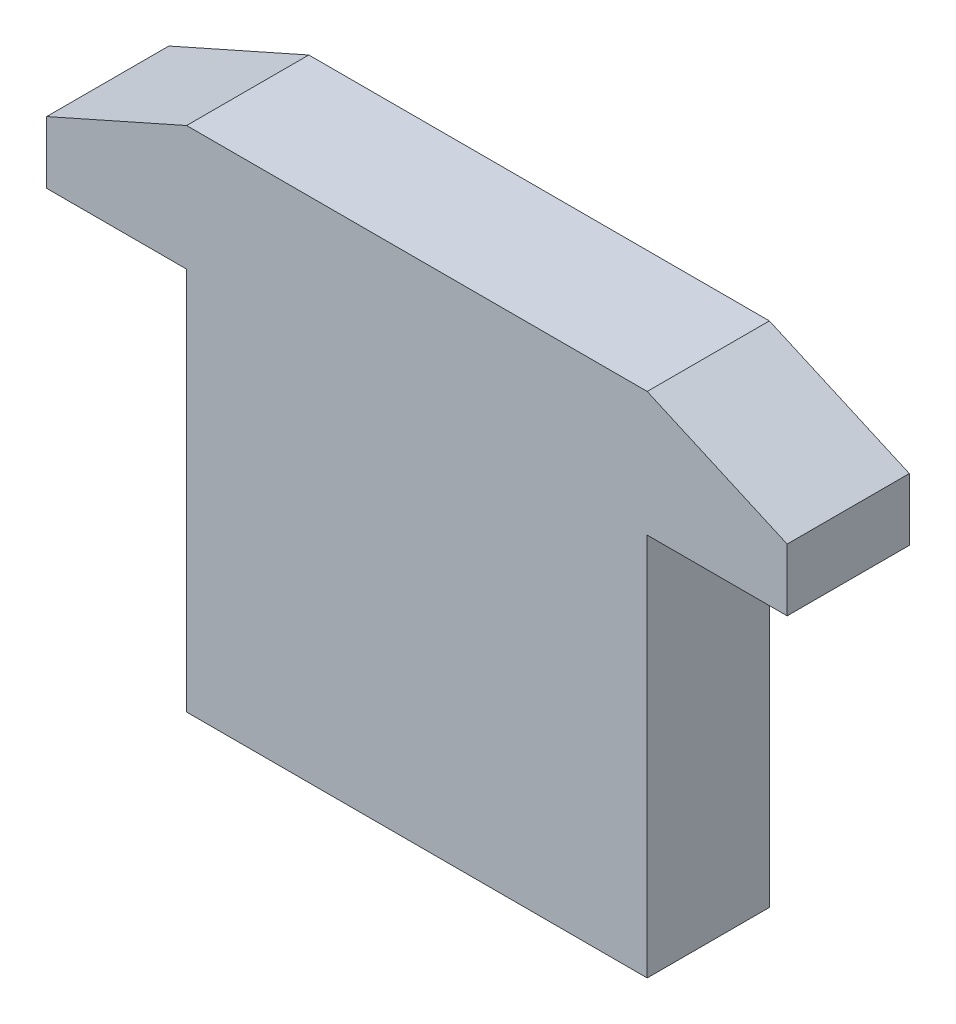
ISO-10303-21;
HEADER;
FILE_DESCRIPTION(('STEP AP214'),'2;1');
FILE_NAME('part.step','',(''),(''),'','','');
FILE_SCHEMA(('AUTOMOTIVE_DESIGN { 1 0 10303 214 1 1 1 1 }'));
ENDSEC;
DATA;
#1=APPLICATION_CONTEXT('core data for automotive mechanical design processes');
#2=APPLICATION_PROTOCOL_DEFINITION('international standard','automotive_design',2000,#1);
#3=PRODUCT_CONTEXT('',#1,'mechanical');
#4=PRODUCT('Part','Part','',(#3));
#5=PRODUCT_RELATED_PRODUCT_CATEGORY('part','',(#4));
#6=PRODUCT_DEFINITION_FORMATION('','',#4);
#7=PRODUCT_DEFINITION_CONTEXT('part definition',#1,'design');
#8=PRODUCT_DEFINITION('design','',#6,#7);
#9=PRODUCT_DEFINITION_SHAPE('','',#8);
#10=(LENGTH_UNIT() NAMED_UNIT(*) SI_UNIT(.MILLI.,.METRE.));
#11=(NAMED_UNIT(*) PLANE_ANGLE_UNIT() SI_UNIT($,.RADIAN.));
#12=(NAMED_UNIT(*) SI_UNIT($,.STERADIAN.) SOLID_ANGLE_UNIT());
#13=UNCERTAINTY_MEASURE_WITH_UNIT(LENGTH_MEASURE(1.E-05),#10,'distance_accuracy_value','');
#14=(GEOMETRIC_REPRESENTATION_CONTEXT(3) GLOBAL_UNCERTAINTY_ASSIGNED_CONTEXT((#13)) GLOBAL_UNIT_ASSIGNED_CONTEXT((#10,
#11,#12)) REPRESENTATION_CONTEXT('',''));
#15=CARTESIAN_POINT('',(0.,0.,0.));
#16=DIRECTION('',(0.,0.,1.));
#17=DIRECTION('',(1.,0.,0.));
#18=AXIS2_PLACEMENT_3D('',#15,#16,#17);
#19=CARTESIAN_POINT('',(-3.1100014,-3.42999822,0.));
#20=DIRECTION('',(0.,0.,-1.));
#21=DIRECTION('',(-1.,0.,0.));
#22=AXIS2_PLACEMENT_3D('',#19,#20,#21);
#23=PLANE('',#22);
#24=DIRECTION('',(0.,1.,0.));
#25=VECTOR('',#24,1.);
#26=CARTESIAN_POINT('',(5.00000016,2.59000244,0.));
#27=LINE('',#26,#25);
#28=CARTESIAN_POINT('',(5.00000016,1.75000158,0.));
#29=VERTEX_POINT('',#28);
#30=CARTESIAN_POINT('',(5.00000015999994,2.59000243999987,0.));
#31=VERTEX_POINT('',#30);
#32=EDGE_CURVE('E134',#29,#31,#27,.T.);
#33=ORIENTED_EDGE('',*,*,#32,.F.);
#34=DIRECTION('',(1.,0.,0.));
#35=VECTOR('',#34,1.);
#36=CARTESIAN_POINT('',(5.00000016,1.75000158,0.));
#37=LINE('',#36,#35);
#38=CARTESIAN_POINT('',(3.1100014,1.75000158,0.));
#39=VERTEX_POINT('',#38);
#40=EDGE_CURVE('E138',#39,#29,#37,.T.);
#41=ORIENTED_EDGE('',*,*,#40,.F.);
#42=DIRECTION('',(0.,1.,0.));
#43=VECTOR('',#42,1.);
#44=CARTESIAN_POINT('',(3.1100014,1.75000158,0.));
#45=LINE('',#44,#43);
#46=CARTESIAN_POINT('',(3.1100014,-3.42999822,0.));
#47=VERTEX_POINT('',#46);
#48=EDGE_CURVE('E107',#47,#39,#45,.T.);
#49=ORIENTED_EDGE('',*,*,#48,.F.);
#50=DIRECTION('',(1.,0.,0.));
#51=VECTOR('',#50,1.);
#52=CARTESIAN_POINT('',(3.1100014,-3.42999822,0.));
#53=LINE('',#52,#51);
#54=CARTESIAN_POINT('',(-3.1100014,-3.42999822,0.));
#55=VERTEX_POINT('',#54);
#56=EDGE_CURVE('E20',#55,#47,#53,.T.);
#57=ORIENTED_EDGE('',*,*,#56,.F.);
#58=DIRECTION('',(0.,1.,0.));
#59=VECTOR('',#58,1.);
#60=CARTESIAN_POINT('',(-3.1100014,-3.42999822,0.));
#61=LINE('',#60,#59);
#62=CARTESIAN_POINT('',(-3.1100014,1.75000158,0.));
#63=VERTEX_POINT('',#62);
#64=EDGE_CURVE('E95',#63,#55,#61,.F.);
#65=ORIENTED_EDGE('',*,*,#64,.F.);
#66=DIRECTION('',(1.,0.,0.));
#67=VECTOR('',#66,1.);
#68=CARTESIAN_POINT('',(-3.1100014,1.75000158,0.));
#69=LINE('',#68,#67);
#70=CARTESIAN_POINT('',(-5.00000016,1.75000158,0.));
#71=VERTEX_POINT('',#70);
#72=EDGE_CURVE('E90',#71,#63,#69,.T.);
#73=ORIENTED_EDGE('',*,*,#72,.F.);
#74=DIRECTION('',(0.,1.,0.));
#75=VECTOR('',#74,1.);
#76=CARTESIAN_POINT('',(-5.00000016,1.75000158,0.));
#77=LINE('',#76,#75);
#78=CARTESIAN_POINT('',(-5.00000016,2.59000244,0.));
#79=VERTEX_POINT('',#78);
#80=EDGE_CURVE('E118',#79,#71,#77,.F.);
#81=ORIENTED_EDGE('',*,*,#80,.F.);
#82=DIRECTION('',(-0.913811751190989,-0.406138010268995,0.));
#83=VECTOR('',#82,1.);
#84=CARTESIAN_POINT('',(-5.00000016,2.59000244,0.));
#85=LINE('',#84,#83);
#86=CARTESIAN_POINT('',(-3.11000140000006,3.43000076000013,0.));
#87=VERTEX_POINT('',#86);
#88=EDGE_CURVE('E122',#87,#79,#85,.T.);
#89=ORIENTED_EDGE('',*,*,#88,.F.);
#90=DIRECTION('',(1.,0.,0.));
#91=VECTOR('',#90,1.);
#92=CARTESIAN_POINT('',(-3.1100014,3.43000076,0.));
#93=LINE('',#92,#91);
#94=CARTESIAN_POINT('',(3.1100014,3.43000076,0.));
#95=VERTEX_POINT('',#94);
#96=EDGE_CURVE('E126',#95,#87,#93,.F.);
#97=ORIENTED_EDGE('',*,*,#96,.F.);
#98=DIRECTION('',(-0.913811751190989,0.406138010268995,0.));
#99=VECTOR('',#98,1.);
#100=CARTESIAN_POINT('',(3.1100014,3.43000076,0.));
#101=LINE('',#100,#99);
#102=EDGE_CURVE('E130',#31,#95,#101,.T.);
#103=ORIENTED_EDGE('',*,*,#102,.F.);
#104=EDGE_LOOP('',(#33,#41,#49,#57,#65,#73,#81,#89,#97,#103));
#105=FACE_BOUND('',#104,.T.);
#106=ADVANCED_FACE('F17',(#105),#23,.T.);
#107=CARTESIAN_POINT('',(3.1100014,-3.42999822,0.));
#108=DIRECTION('',(0.,-1.,0.));
#109=DIRECTION('',(0.,0.,-1.));
#110=AXIS2_PLACEMENT_3D('',#107,#108,#109);
#111=PLANE('',#110);
#112=DIRECTION('',(0.,0.,-1.));
#113=VECTOR('',#112,1.);
#114=CARTESIAN_POINT('',(3.1100014,-3.42999822,0.));
#115=LINE('',#114,#113);
#116=CARTESIAN_POINT('',(3.1100014,-3.42999822,1.65));
#117=VERTEX_POINT('',#116);
#118=EDGE_CURVE('E142',#117,#47,#115,.T.);
#119=ORIENTED_EDGE('',*,*,#118,.F.);
#120=DIRECTION('',(-1.,0.,0.));
#121=VECTOR('',#120,1.);
#122=CARTESIAN_POINT('',(-3.1100014,-3.42999822,1.65));
#123=LINE('',#122,#121);
#124=CARTESIAN_POINT('',(-3.1100014,-3.42999822,1.65));
#125=VERTEX_POINT('',#124);
#126=EDGE_CURVE('E113',#117,#125,#123,.T.);
#127=ORIENTED_EDGE('',*,*,#126,.T.);
#128=DIRECTION('',(0.,0.,1.));
#129=VECTOR('',#128,1.);
#130=CARTESIAN_POINT('',(-3.1100014,-3.42999822,0.));
#131=LINE('',#130,#129);
#132=EDGE_CURVE('E100',#55,#125,#131,.T.);
#133=ORIENTED_EDGE('',*,*,#132,.F.);
#134=ORIENTED_EDGE('',*,*,#56,.T.);
#135=EDGE_LOOP('',(#119,#127,#133,#134));
#136=FACE_BOUND('',#135,.T.);
#137=ADVANCED_FACE('F112',(#136),#111,.T.);
#138=CARTESIAN_POINT('',(-3.1100014,-3.42999822,0.));
#139=DIRECTION('',(-1.,0.,0.));
#140=DIRECTION('',(0.,0.,1.));
#141=AXIS2_PLACEMENT_3D('',#138,#139,#140);
#142=PLANE('',#141);
#143=ORIENTED_EDGE('',*,*,#132,.T.);
#144=DIRECTION('',(0.,1.,0.));
#145=VECTOR('',#144,1.);
#146=CARTESIAN_POINT('',(-3.1100014,-3.42999822,1.65));
#147=LINE('',#146,#145);
#148=CARTESIAN_POINT('',(-3.1100014,1.75000158,1.65));
#149=VERTEX_POINT('',#148);
#150=EDGE_CURVE('E147',#125,#149,#147,.T.);
#151=ORIENTED_EDGE('',*,*,#150,.T.);
#152=DIRECTION('',(0.,0.,-1.));
#153=VECTOR('',#152,1.);
#154=CARTESIAN_POINT('',(-3.1100014,1.75000158,0.));
#155=LINE('',#154,#153);
#156=EDGE_CURVE('E102',#63,#149,#155,.F.);
#157=ORIENTED_EDGE('',*,*,#156,.F.);
#158=ORIENTED_EDGE('',*,*,#64,.T.);
#159=EDGE_LOOP('',(#143,#151,#157,#158));
#160=FACE_BOUND('',#159,.T.);
#161=ADVANCED_FACE('F97',(#160),#142,.T.);
#162=CARTESIAN_POINT('',(-3.1100014,1.75000158,0.));
#163=DIRECTION('',(0.,-1.,0.));
#164=DIRECTION('',(0.,0.,-1.));
#165=AXIS2_PLACEMENT_3D('',#162,#163,#164);
#166=PLANE('',#165);
#167=ORIENTED_EDGE('',*,*,#156,.T.);
#168=DIRECTION('',(-1.,0.,0.));
#169=VECTOR('',#168,1.);
#170=CARTESIAN_POINT('',(-3.1100014,1.75000158,1.65));
#171=LINE('',#170,#169);
#172=CARTESIAN_POINT('',(-5.00000016,1.75000158,1.65));
#173=VERTEX_POINT('',#172);
#174=EDGE_CURVE('E149',#149,#173,#171,.T.);
#175=ORIENTED_EDGE('',*,*,#174,.T.);
#176=DIRECTION('',(0.,0.,1.));
#177=VECTOR('',#176,1.);
#178=CARTESIAN_POINT('',(-5.00000016,1.75000158,0.));
#179=LINE('',#178,#177);
#180=EDGE_CURVE('E120',#71,#173,#179,.T.);
#181=ORIENTED_EDGE('',*,*,#180,.F.);
#182=ORIENTED_EDGE('',*,*,#72,.T.);
#183=EDGE_LOOP('',(#167,#175,#181,#182));
#184=FACE_BOUND('',#183,.T.);
#185=ADVANCED_FACE('F198',(#184),#166,.T.);
#186=CARTESIAN_POINT('',(-5.00000016,1.75000158,0.));
#187=DIRECTION('',(-1.,0.,0.));
#188=DIRECTION('',(0.,0.,1.));
#189=AXIS2_PLACEMENT_3D('',#186,#187,#188);
#190=PLANE('',#189);
#191=ORIENTED_EDGE('',*,*,#180,.T.);
#192=DIRECTION('',(0.,1.,0.));
#193=VECTOR('',#192,1.);
#194=CARTESIAN_POINT('',(-5.00000016,-3.42999822,1.65));
#195=LINE('',#194,#193);
#196=CARTESIAN_POINT('',(-5.00000016,2.59000244,1.65));
#197=VERTEX_POINT('',#196);
#198=EDGE_CURVE('E152',#173,#197,#195,.T.);
#199=ORIENTED_EDGE('',*,*,#198,.T.);
#200=DIRECTION('',(0.,0.,1.));
#201=VECTOR('',#200,1.);
#202=CARTESIAN_POINT('',(-5.00000016,2.59000244,0.));
#203=LINE('',#202,#201);
#204=EDGE_CURVE('E124',#79,#197,#203,.T.);
#205=ORIENTED_EDGE('',*,*,#204,.F.);
#206=ORIENTED_EDGE('',*,*,#80,.T.);
#207=EDGE_LOOP('',(#191,#199,#205,#206));
#208=FACE_BOUND('',#207,.T.);
#209=ADVANCED_FACE('F197',(#208),#190,.T.);
#210=CARTESIAN_POINT('',(-5.00000016,2.59000244,0.));
#211=DIRECTION('',(-0.406138010268995,0.913811751190989,0.));
#212=DIRECTION('',(-0.913811751190989,-0.406138010268995,0.));
#213=AXIS2_PLACEMENT_3D('',#210,#211,#212);
#214=PLANE('',#213);
#215=ORIENTED_EDGE('',*,*,#204,.T.);
#216=DIRECTION('',(0.913811751191102,0.406138010268739,0.));
#217=VECTOR('',#216,1.);
#218=CARTESIAN_POINT('',(-5.00000016,2.59000244,1.65));
#219=LINE('',#218,#217);
#220=CARTESIAN_POINT('',(-3.11000140000012,3.43000076000026,1.65));
#221=VERTEX_POINT('',#220);
#222=EDGE_CURVE('E155',#197,#221,#219,.T.);
#223=ORIENTED_EDGE('',*,*,#222,.T.);
#224=DIRECTION('',(0.,0.,1.));
#225=VECTOR('',#224,1.);
#226=CARTESIAN_POINT('',(-3.1100014,3.43000076,0.));
#227=LINE('',#226,#225);
#228=EDGE_CURVE('E128',#87,#221,#227,.T.);
#229=ORIENTED_EDGE('',*,*,#228,.F.);
#230=ORIENTED_EDGE('',*,*,#88,.T.);
#231=EDGE_LOOP('',(#215,#223,#229,#230));
#232=FACE_BOUND('',#231,.T.);
#233=ADVANCED_FACE('F191',(#232),#214,.T.);
#234=CARTESIAN_POINT('',(-3.1100014,3.43000076,0.));
#235=DIRECTION('',(0.,1.,0.));
#236=DIRECTION('',(0.,0.,1.));
#237=AXIS2_PLACEMENT_3D('',#234,#235,#236);
#238=PLANE('',#237);
#239=ORIENTED_EDGE('',*,*,#228,.T.);
#240=DIRECTION('',(-1.,0.,0.));
#241=VECTOR('',#240,1.);
#242=CARTESIAN_POINT('',(-3.1100014,3.43000076,1.65));
#243=LINE('',#242,#241);
#244=CARTESIAN_POINT('',(3.1100014,3.43000076,1.65));
#245=VERTEX_POINT('',#244);
#246=EDGE_CURVE('E158',#221,#245,#243,.F.);
#247=ORIENTED_EDGE('',*,*,#246,.T.);
#248=DIRECTION('',(0.,0.,1.));
#249=VECTOR('',#248,1.);
#250=CARTESIAN_POINT('',(3.1100014,3.43000076,0.));
#251=LINE('',#250,#249);
#252=EDGE_CURVE('E132',#95,#245,#251,.T.);
#253=ORIENTED_EDGE('',*,*,#252,.F.);
#254=ORIENTED_EDGE('',*,*,#96,.T.);
#255=EDGE_LOOP('',(#239,#247,#253,#254));
#256=FACE_BOUND('',#255,.T.);
#257=ADVANCED_FACE('F187',(#256),#238,.T.);
#258=CARTESIAN_POINT('',(3.1100014,3.43000076,0.));
#259=DIRECTION('',(0.406138010268995,0.913811751190989,0.));
#260=DIRECTION('',(-0.913811751190989,0.406138010268995,0.));
#261=AXIS2_PLACEMENT_3D('',#258,#259,#260);
#262=PLANE('',#261);
#263=ORIENTED_EDGE('',*,*,#252,.T.);
#264=DIRECTION('',(0.913811751191102,-0.406138010268739,0.));
#265=VECTOR('',#264,1.);
#266=CARTESIAN_POINT('',(3.1100014,3.43000076,1.65));
#267=LINE('',#266,#265);
#268=CARTESIAN_POINT('',(5.00000015999988,2.59000243999974,1.65));
#269=VERTEX_POINT('',#268);
#270=EDGE_CURVE('E161',#245,#269,#267,.T.);
#271=ORIENTED_EDGE('',*,*,#270,.T.);
#272=DIRECTION('',(0.,0.,-1.));
#273=VECTOR('',#272,1.);
#274=CARTESIAN_POINT('',(5.00000016,2.59000244,0.));
#275=LINE('',#274,#273);
#276=EDGE_CURVE('E136',#31,#269,#275,.F.);
#277=ORIENTED_EDGE('',*,*,#276,.F.);
#278=ORIENTED_EDGE('',*,*,#102,.T.);
#279=EDGE_LOOP('',(#263,#271,#277,#278));
#280=FACE_BOUND('',#279,.T.);
#281=ADVANCED_FACE('F181',(#280),#262,.T.);
#282=CARTESIAN_POINT('',(5.00000016,2.59000244,0.));
#283=DIRECTION('',(1.,0.,0.));
#284=DIRECTION('',(0.,0.,-1.));
#285=AXIS2_PLACEMENT_3D('',#282,#283,#284);
#286=PLANE('',#285);
#287=ORIENTED_EDGE('',*,*,#276,.T.);
#288=DIRECTION('',(0.,1.,0.));
#289=VECTOR('',#288,1.);
#290=CARTESIAN_POINT('',(5.00000016,-3.42999822,1.65));
#291=LINE('',#290,#289);
#292=CARTESIAN_POINT('',(5.00000016,1.75000158,1.65));
#293=VERTEX_POINT('',#292);
#294=EDGE_CURVE('E164',#269,#293,#291,.F.);
#295=ORIENTED_EDGE('',*,*,#294,.T.);
#296=DIRECTION('',(0.,0.,-1.));
#297=VECTOR('',#296,1.);
#298=CARTESIAN_POINT('',(5.00000016,1.75000158,0.));
#299=LINE('',#298,#297);
#300=EDGE_CURVE('E140',#29,#293,#299,.F.);
#301=ORIENTED_EDGE('',*,*,#300,.F.);
#302=ORIENTED_EDGE('',*,*,#32,.T.);
#303=EDGE_LOOP('',(#287,#295,#301,#302));
#304=FACE_BOUND('',#303,.T.);
#305=ADVANCED_FACE('F177',(#304),#286,.T.);
#306=CARTESIAN_POINT('',(5.00000016,1.75000158,0.));
#307=DIRECTION('',(0.,-1.,0.));
#308=DIRECTION('',(0.,0.,-1.));
#309=AXIS2_PLACEMENT_3D('',#306,#307,#308);
#310=PLANE('',#309);
#311=ORIENTED_EDGE('',*,*,#300,.T.);
#312=DIRECTION('',(-1.,0.,0.));
#313=VECTOR('',#312,1.);
#314=CARTESIAN_POINT('',(-3.1100014,1.75000158,1.65));
#315=LINE('',#314,#313);
#316=CARTESIAN_POINT('',(3.1100014,1.75000158,1.65));
#317=VERTEX_POINT('',#316);
#318=EDGE_CURVE('E26',#293,#317,#315,.T.);
#319=ORIENTED_EDGE('',*,*,#318,.T.);
#320=DIRECTION('',(0.,0.,-1.));
#321=VECTOR('',#320,1.);
#322=CARTESIAN_POINT('',(3.1100014,1.75000158,0.));
#323=LINE('',#322,#321);
#324=EDGE_CURVE('E34',#39,#317,#323,.F.);
#325=ORIENTED_EDGE('',*,*,#324,.F.);
#326=ORIENTED_EDGE('',*,*,#40,.T.);
#327=EDGE_LOOP('',(#311,#319,#325,#326));
#328=FACE_BOUND('',#327,.T.);
#329=ADVANCED_FACE('F170',(#328),#310,.T.);
#330=CARTESIAN_POINT('',(3.1100014,1.75000158,0.));
#331=DIRECTION('',(1.,0.,0.));
#332=DIRECTION('',(0.,0.,-1.));
#333=AXIS2_PLACEMENT_3D('',#330,#331,#332);
#334=PLANE('',#333);
#335=ORIENTED_EDGE('',*,*,#324,.T.);
#336=DIRECTION('',(0.,1.,0.));
#337=VECTOR('',#336,1.);
#338=CARTESIAN_POINT('',(3.1100014,-3.42999822,1.65));
#339=LINE('',#338,#337);
#340=EDGE_CURVE('E11',#317,#117,#339,.F.);
#341=ORIENTED_EDGE('',*,*,#340,.T.);
#342=ORIENTED_EDGE('',*,*,#118,.T.);
#343=ORIENTED_EDGE('',*,*,#48,.T.);
#344=EDGE_LOOP('',(#335,#341,#342,#343));
#345=FACE_BOUND('',#344,.T.);
#346=ADVANCED_FACE('F199',(#345),#334,.T.);
#347=CARTESIAN_POINT('',(-3.1100014,-3.42999822,1.65));
#348=DIRECTION('',(0.,0.,-1.));
#349=DIRECTION('',(-1.,0.,0.));
#350=AXIS2_PLACEMENT_3D('',#347,#348,#349);
#351=PLANE('',#350);
#352=ORIENTED_EDGE('',*,*,#318,.F.);
#353=ORIENTED_EDGE('',*,*,#294,.F.);
#354=ORIENTED_EDGE('',*,*,#270,.F.);
#355=ORIENTED_EDGE('',*,*,#246,.F.);
#356=ORIENTED_EDGE('',*,*,#222,.F.);
#357=ORIENTED_EDGE('',*,*,#198,.F.);
#358=ORIENTED_EDGE('',*,*,#174,.F.);
#359=ORIENTED_EDGE('',*,*,#150,.F.);
#360=ORIENTED_EDGE('',*,*,#126,.F.);
#361=ORIENTED_EDGE('',*,*,#340,.F.);
#362=EDGE_LOOP('',(#352,#353,#354,#355,#356,#357,#358,#359,#360,#361));
#363=FACE_BOUND('',#362,.T.);
#364=ADVANCED_FACE('F174',(#363),#351,.F.);
#365=CLOSED_SHELL('',(#106,#137,#161,#185,#209,#233,#257,#281,#305,#329,#346,#364));
#366=MANIFOLD_SOLID_BREP('B1',#365);
#367=ADVANCED_BREP_SHAPE_REPRESENTATION('',(#18,#366),#14);
#368=SHAPE_DEFINITION_REPRESENTATION(#9,#367);
ENDSEC;
END-ISO-10303-21;
